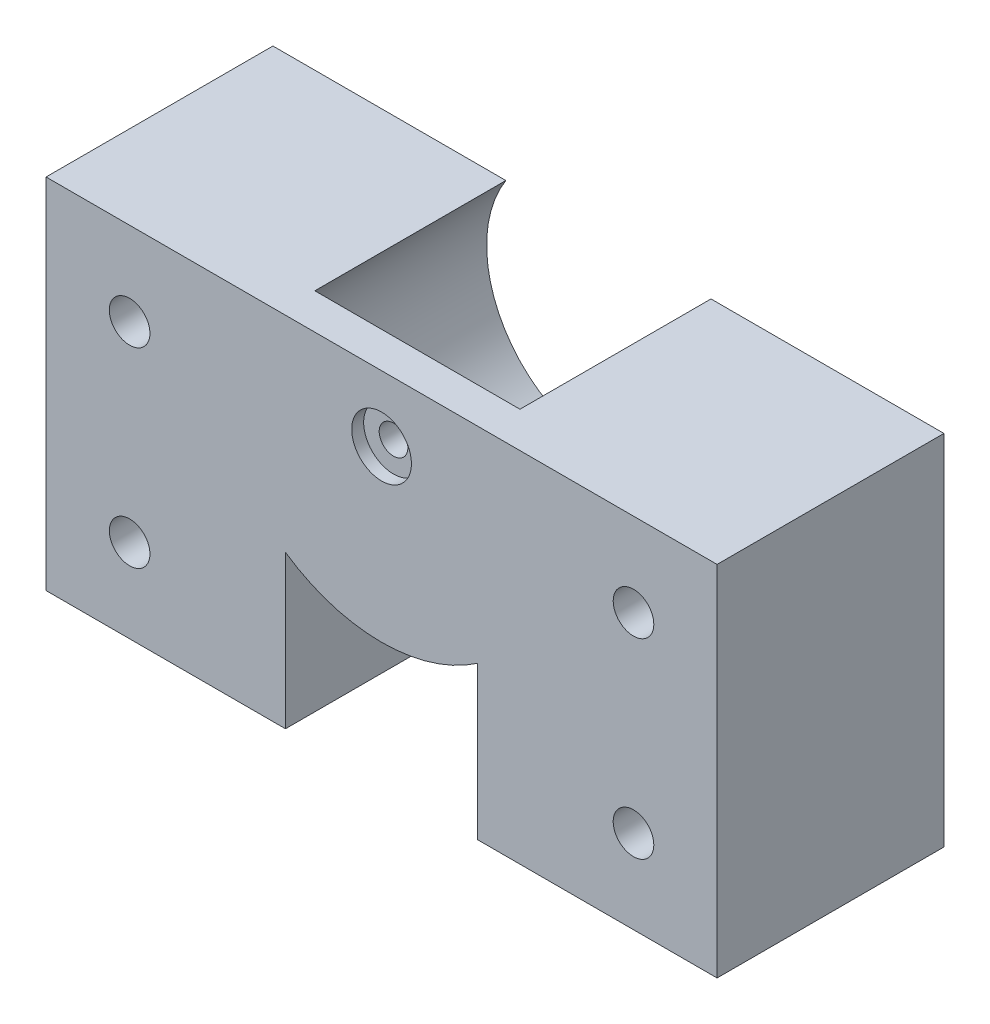
ISO-10303-21;
HEADER;
FILE_DESCRIPTION(('STEP AP214'),'2;1');
FILE_NAME('part.step','',(''),(''),'','','');
FILE_SCHEMA(('AUTOMOTIVE_DESIGN { 1 0 10303 214 1 1 1 1 }'));
ENDSEC;
DATA;
#1=APPLICATION_CONTEXT('core data for automotive mechanical design processes');
#2=APPLICATION_PROTOCOL_DEFINITION('international standard','automotive_design',2000,#1);
#3=PRODUCT_CONTEXT('',#1,'mechanical');
#4=PRODUCT('Part','Part','',(#3));
#5=PRODUCT_RELATED_PRODUCT_CATEGORY('part','',(#4));
#6=PRODUCT_DEFINITION_FORMATION('','',#4);
#7=PRODUCT_DEFINITION_CONTEXT('part definition',#1,'design');
#8=PRODUCT_DEFINITION('design','',#6,#7);
#9=PRODUCT_DEFINITION_SHAPE('','',#8);
#10=(LENGTH_UNIT() NAMED_UNIT(*) SI_UNIT(.MILLI.,.METRE.));
#11=(NAMED_UNIT(*) PLANE_ANGLE_UNIT() SI_UNIT($,.RADIAN.));
#12=(NAMED_UNIT(*) SI_UNIT($,.STERADIAN.) SOLID_ANGLE_UNIT());
#13=UNCERTAINTY_MEASURE_WITH_UNIT(LENGTH_MEASURE(1.E-05),#10,'distance_accuracy_value','');
#14=(GEOMETRIC_REPRESENTATION_CONTEXT(3) GLOBAL_UNCERTAINTY_ASSIGNED_CONTEXT((#13)) GLOBAL_UNIT_ASSIGNED_CONTEXT((#10,
#11,#12)) REPRESENTATION_CONTEXT('',''));
#15=CARTESIAN_POINT('',(0.,0.,0.));
#16=DIRECTION('',(0.,0.,1.));
#17=DIRECTION('',(1.,0.,0.));
#18=AXIS2_PLACEMENT_3D('',#15,#16,#17);
#19=CARTESIAN_POINT('',(28.1,-5.50000000000001,23.8083261120685));
#20=DIRECTION('',(0.,0.,-1.));
#21=DIRECTION('',(-1.,0.,0.));
#22=AXIS2_PLACEMENT_3D('',#19,#20,#21);
#23=CYLINDRICAL_SURFACE('',#22,1.2);
#24=CARTESIAN_POINT('',(28.1,-5.50000000000001,16.));
#25=DIRECTION('',(0.,0.,1.));
#26=DIRECTION('',(1.,0.,0.));
#27=AXIS2_PLACEMENT_3D('',#24,#25,#26);
#28=CIRCLE('',#27,1.2);
#29=CARTESIAN_POINT('',(29.3,-5.50000000000001,16.));
#30=VERTEX_POINT('',#29);
#31=EDGE_CURVE('E207',#30,#30,#28,.T.);
#32=ORIENTED_EDGE('',*,*,#31,.F.);
#33=EDGE_LOOP('',(#32));
#34=FACE_BOUND('',#33,.T.);
#35=CARTESIAN_POINT('',(28.1,-5.50000000000001,18.));
#36=DIRECTION('',(0.,0.,1.));
#37=DIRECTION('',(1.,0.,0.));
#38=AXIS2_PLACEMENT_3D('',#35,#36,#37);
#39=CIRCLE('',#38,1.2);
#40=CARTESIAN_POINT('',(29.3,-5.50000000000001,18.));
#41=VERTEX_POINT('',#40);
#42=EDGE_CURVE('E40',#41,#41,#39,.F.);
#43=ORIENTED_EDGE('',*,*,#42,.F.);
#44=EDGE_LOOP('',(#43));
#45=FACE_BOUND('',#44,.T.);
#46=ADVANCED_FACE('F36',(#34,#45),#23,.F.);
#47=CARTESIAN_POINT('',(-2.08166817117217E-13,-30.,16.));
#48=DIRECTION('',(0.,1.,0.));
#49=DIRECTION('',(-1.,0.,0.));
#50=AXIS2_PLACEMENT_3D('',#47,#48,#49);
#51=PLANE('',#50);
#52=DIRECTION('',(0.,0.,-1.));
#53=VECTOR('',#52,1.);
#54=CARTESIAN_POINT('',(36.15,-30.,19.001));
#55=LINE('',#54,#53);
#56=CARTESIAN_POINT('',(36.15,-30.,19.));
#57=VERTEX_POINT('',#56);
#58=CARTESIAN_POINT('',(36.15,-30.,0.));
#59=VERTEX_POINT('',#58);
#60=EDGE_CURVE('E123',#57,#59,#55,.T.);
#61=ORIENTED_EDGE('',*,*,#60,.T.);
#62=DIRECTION('',(1.,0.,0.));
#63=VECTOR('',#62,1.);
#64=CARTESIAN_POINT('',(-2.08166817117217E-13,-30.,0.));
#65=LINE('',#64,#63);
#66=CARTESIAN_POINT('',(56.2,-30.,0.));
#67=VERTEX_POINT('',#66);
#68=EDGE_CURVE('E163',#59,#67,#65,.T.);
#69=ORIENTED_EDGE('',*,*,#68,.T.);
#70=DIRECTION('',(0.,0.,-1.));
#71=VECTOR('',#70,1.);
#72=CARTESIAN_POINT('',(56.2,-30.,16.));
#73=LINE('',#72,#71);
#74=CARTESIAN_POINT('',(56.2,-29.9999999999996,19.));
#75=VERTEX_POINT('',#74);
#76=EDGE_CURVE('E172',#75,#67,#73,.T.);
#77=ORIENTED_EDGE('',*,*,#76,.F.);
#78=DIRECTION('',(1.,0.,0.));
#79=VECTOR('',#78,1.);
#80=CARTESIAN_POINT('',(-2.08166817117217E-13,-30.,19.));
#81=LINE('',#80,#79);
#82=EDGE_CURVE('E141',#57,#75,#81,.T.);
#83=ORIENTED_EDGE('',*,*,#82,.F.);
#84=EDGE_LOOP('',(#61,#69,#77,#83));
#85=FACE_BOUND('',#84,.T.);
#86=ADVANCED_FACE('F233',(#85),#51,.F.);
#87=DIRECTION('',(0.,0.,-1.));
#88=VECTOR('',#87,1.);
#89=CARTESIAN_POINT('',(20.05,-30.,19.001));
#90=LINE('',#89,#88);
#91=CARTESIAN_POINT('',(20.05,-29.9999999999999,19.));
#92=VERTEX_POINT('',#91);
#93=CARTESIAN_POINT('',(20.05,-30.,0.));
#94=VERTEX_POINT('',#93);
#95=EDGE_CURVE('E117',#92,#94,#90,.T.);
#96=ORIENTED_EDGE('',*,*,#95,.F.);
#97=CARTESIAN_POINT('',(-2.08166817117217E-13,-30.,19.));
#98=VERTEX_POINT('',#97);
#99=EDGE_CURVE('E130',#98,#92,#81,.T.);
#100=ORIENTED_EDGE('',*,*,#99,.F.);
#101=DIRECTION('',(0.,0.,-1.));
#102=VECTOR('',#101,1.);
#103=CARTESIAN_POINT('',(-2.08166817117217E-13,-30.,16.));
#104=LINE('',#103,#102);
#105=CARTESIAN_POINT('',(-2.08166817117217E-13,-30.,0.));
#106=VERTEX_POINT('',#105);
#107=EDGE_CURVE('E175',#98,#106,#104,.T.);
#108=ORIENTED_EDGE('',*,*,#107,.T.);
#109=EDGE_CURVE('E132',#106,#94,#65,.T.);
#110=ORIENTED_EDGE('',*,*,#109,.T.);
#111=EDGE_LOOP('',(#96,#100,#108,#110));
#112=FACE_BOUND('',#111,.T.);
#113=ADVANCED_FACE('F128',(#112),#51,.F.);
#114=CARTESIAN_POINT('',(28.1,-5.50000000000001,0.));
#115=DIRECTION('',(0.,0.,1.));
#116=DIRECTION('',(1.,0.,0.));
#117=AXIS2_PLACEMENT_3D('',#114,#115,#116);
#118=PLANE('',#117);
#119=CARTESIAN_POINT('',(49.1999999999998,-7.,0.));
#120=DIRECTION('',(0.,0.,-1.));
#121=DIRECTION('',(-1.,0.,0.));
#122=AXIS2_PLACEMENT_3D('',#119,#120,#121);
#123=CIRCLE('',#122,1.7);
#124=CARTESIAN_POINT('',(47.4999999999998,-7.,0.));
#125=VERTEX_POINT('',#124);
#126=EDGE_CURVE('E220',#125,#125,#123,.T.);
#127=ORIENTED_EDGE('',*,*,#126,.F.);
#128=EDGE_LOOP('',(#127));
#129=FACE_BOUND('',#128,.T.);
#130=CARTESIAN_POINT('',(49.1999999999998,-23.,0.));
#131=DIRECTION('',(0.,0.,-1.));
#132=DIRECTION('',(1.,0.,0.));
#133=AXIS2_PLACEMENT_3D('',#130,#131,#132);
#134=CIRCLE('',#133,1.69999999999999);
#135=CARTESIAN_POINT('',(50.8999999999998,-23.,0.));
#136=VERTEX_POINT('',#135);
#137=EDGE_CURVE('E199',#136,#136,#134,.T.);
#138=ORIENTED_EDGE('',*,*,#137,.F.);
#139=EDGE_LOOP('',(#138));
#140=FACE_BOUND('',#139,.T.);
#141=CARTESIAN_POINT('',(7.0000000000001,-23.0000000000001,0.));
#142=DIRECTION('',(0.,0.,-1.));
#143=DIRECTION('',(-1.,0.,0.));
#144=AXIS2_PLACEMENT_3D('',#141,#142,#143);
#145=CIRCLE('',#144,1.70000000000001);
#146=CARTESIAN_POINT('',(5.3000000000001,-23.0000000000001,0.));
#147=VERTEX_POINT('',#146);
#148=EDGE_CURVE('E208',#147,#147,#145,.T.);
#149=ORIENTED_EDGE('',*,*,#148,.F.);
#150=EDGE_LOOP('',(#149));
#151=FACE_BOUND('',#150,.T.);
#152=CARTESIAN_POINT('',(7.00000000000008,-6.99999999999992,0.));
#153=DIRECTION('',(0.,0.,-1.));
#154=DIRECTION('',(1.,0.,0.));
#155=AXIS2_PLACEMENT_3D('',#152,#153,#154);
#156=CIRCLE('',#155,1.7);
#157=CARTESIAN_POINT('',(8.70000000000008,-6.99999999999992,0.));
#158=VERTEX_POINT('',#157);
#159=EDGE_CURVE('E200',#158,#158,#156,.T.);
#160=ORIENTED_EDGE('',*,*,#159,.F.);
#161=EDGE_LOOP('',(#160));
#162=FACE_BOUND('',#161,.T.);
#163=DIRECTION('',(0.,1.,0.));
#164=VECTOR('',#163,1.);
#165=CARTESIAN_POINT('',(36.15,-30.,0.));
#166=LINE('',#165,#164);
#167=CARTESIAN_POINT('',(36.15,-17.1977561951,0.));
#168=VERTEX_POINT('',#167);
#169=EDGE_CURVE('E189',#59,#168,#166,.T.);
#170=ORIENTED_EDGE('',*,*,#169,.T.);
#171=CARTESIAN_POINT('',(28.1,-5.50000000000001,0.));
#172=DIRECTION('',(0.,0.,-1.));
#173=DIRECTION('',(1.,0.,0.));
#174=AXIS2_PLACEMENT_3D('',#171,#172,#173);
#175=CIRCLE('',#174,14.2);
#176=CARTESIAN_POINT('',(20.05,-17.1977561951,0.));
#177=VERTEX_POINT('',#176);
#178=EDGE_CURVE('E187',#168,#177,#175,.T.);
#179=ORIENTED_EDGE('',*,*,#178,.T.);
#180=DIRECTION('',(0.,-1.,0.));
#181=VECTOR('',#180,1.);
#182=CARTESIAN_POINT('',(20.05,-30.,0.));
#183=LINE('',#182,#181);
#184=EDGE_CURVE('E133',#177,#94,#183,.T.);
#185=ORIENTED_EDGE('',*,*,#184,.T.);
#186=ORIENTED_EDGE('',*,*,#109,.F.);
#187=DIRECTION('',(0.,-1.,0.));
#188=VECTOR('',#187,1.);
#189=CARTESIAN_POINT('',(0.,0.,0.));
#190=LINE('',#189,#188);
#191=CARTESIAN_POINT('',(0.,0.,0.));
#192=VERTEX_POINT('',#191);
#193=EDGE_CURVE('E161',#192,#106,#190,.T.);
#194=ORIENTED_EDGE('',*,*,#193,.F.);
#195=DIRECTION('',(-1.,0.,0.));
#196=VECTOR('',#195,1.);
#197=CARTESIAN_POINT('',(19.5098894069982,0.,0.));
#198=LINE('',#197,#196);
#199=CARTESIAN_POINT('',(19.5098894069982,0.,0.));
#200=VERTEX_POINT('',#199);
#201=EDGE_CURVE('E159',#200,#192,#198,.T.);
#202=ORIENTED_EDGE('',*,*,#201,.F.);
#203=CARTESIAN_POINT('',(28.1,-5.50000000000001,0.));
#204=DIRECTION('',(0.,0.,-1.));
#205=DIRECTION('',(1.,0.,0.));
#206=AXIS2_PLACEMENT_3D('',#203,#204,#205);
#207=CIRCLE('',#206,10.2);
#208=CARTESIAN_POINT('',(36.6901105930017,0.,0.));
#209=VERTEX_POINT('',#208);
#210=EDGE_CURVE('E60',#209,#200,#207,.T.);
#211=ORIENTED_EDGE('',*,*,#210,.F.);
#212=DIRECTION('',(-1.,0.,0.));
#213=VECTOR('',#212,1.);
#214=CARTESIAN_POINT('',(35.8259303646874,0.,0.));
#215=LINE('',#214,#213);
#216=CARTESIAN_POINT('',(56.1999999999998,0.,0.));
#217=VERTEX_POINT('',#216);
#218=EDGE_CURVE('E157',#217,#209,#215,.T.);
#219=ORIENTED_EDGE('',*,*,#218,.F.);
#220=DIRECTION('',(0.,1.,0.));
#221=VECTOR('',#220,1.);
#222=CARTESIAN_POINT('',(56.1999999999998,0.,0.));
#223=LINE('',#222,#221);
#224=EDGE_CURVE('E165',#67,#217,#223,.T.);
#225=ORIENTED_EDGE('',*,*,#224,.F.);
#226=ORIENTED_EDGE('',*,*,#68,.F.);
#227=EDGE_LOOP('',(#170,#179,#185,#186,#194,#202,#211,#219,#225,#226));
#228=FACE_BOUND('',#227,.T.);
#229=ADVANCED_FACE('F184',(#129,#140,#151,#162,#228),#118,.F.);
#230=CARTESIAN_POINT('',(0.,0.,19.));
#231=DIRECTION('',(0.,0.,1.));
#232=DIRECTION('',(1.,0.,0.));
#233=AXIS2_PLACEMENT_3D('',#230,#231,#232);
#234=PLANE('',#233);
#235=CARTESIAN_POINT('',(28.1,-5.50000000000001,19.));
#236=DIRECTION('',(0.,0.,1.));
#237=DIRECTION('',(1.,0.,0.));
#238=AXIS2_PLACEMENT_3D('',#235,#236,#237);
#239=CIRCLE('',#238,2.5);
#240=CARTESIAN_POINT('',(30.6,-5.50000000000001,19.));
#241=VERTEX_POINT('',#240);
#242=EDGE_CURVE('E243',#241,#241,#239,.T.);
#243=ORIENTED_EDGE('',*,*,#242,.F.);
#244=EDGE_LOOP('',(#243));
#245=FACE_BOUND('',#244,.T.);
#246=CARTESIAN_POINT('',(7.00000000000008,-6.99999999999992,19.));
#247=DIRECTION('',(0.,0.,1.));
#248=DIRECTION('',(1.,0.,0.));
#249=AXIS2_PLACEMENT_3D('',#246,#247,#248);
#250=CIRCLE('',#249,1.7);
#251=CARTESIAN_POINT('',(8.70000000000008,-6.99999999999992,19.));
#252=VERTEX_POINT('',#251);
#253=EDGE_CURVE('E203',#252,#252,#250,.F.);
#254=ORIENTED_EDGE('',*,*,#253,.T.);
#255=EDGE_LOOP('',(#254));
#256=FACE_BOUND('',#255,.T.);
#257=CARTESIAN_POINT('',(7.0000000000001,-23.0000000000001,19.));
#258=DIRECTION('',(0.,0.,1.));
#259=DIRECTION('',(1.,0.,0.));
#260=AXIS2_PLACEMENT_3D('',#257,#258,#259);
#261=CIRCLE('',#260,1.70000000000001);
#262=CARTESIAN_POINT('',(8.70000000000011,-23.0000000000001,19.));
#263=VERTEX_POINT('',#262);
#264=EDGE_CURVE('E204',#263,#263,#261,.F.);
#265=ORIENTED_EDGE('',*,*,#264,.T.);
#266=EDGE_LOOP('',(#265));
#267=FACE_BOUND('',#266,.T.);
#268=CARTESIAN_POINT('',(49.1999999999998,-23.,19.));
#269=DIRECTION('',(0.,0.,1.));
#270=DIRECTION('',(1.,0.,0.));
#271=AXIS2_PLACEMENT_3D('',#268,#269,#270);
#272=CIRCLE('',#271,1.69999999999999);
#273=CARTESIAN_POINT('',(50.8999999999998,-23.,19.));
#274=VERTEX_POINT('',#273);
#275=EDGE_CURVE('E211',#274,#274,#272,.F.);
#276=ORIENTED_EDGE('',*,*,#275,.T.);
#277=EDGE_LOOP('',(#276));
#278=FACE_BOUND('',#277,.T.);
#279=CARTESIAN_POINT('',(49.1999999999998,-7.,19.));
#280=DIRECTION('',(0.,0.,1.));
#281=DIRECTION('',(1.,0.,0.));
#282=AXIS2_PLACEMENT_3D('',#279,#280,#281);
#283=CIRCLE('',#282,1.7);
#284=CARTESIAN_POINT('',(50.8999999999998,-7.,19.));
#285=VERTEX_POINT('',#284);
#286=EDGE_CURVE('E152',#285,#285,#283,.F.);
#287=ORIENTED_EDGE('',*,*,#286,.T.);
#288=EDGE_LOOP('',(#287));
#289=FACE_BOUND('',#288,.T.);
#290=CARTESIAN_POINT('',(28.1,-5.50000000000001,19.));
#291=DIRECTION('',(0.,0.,1.));
#292=DIRECTION('',(1.,0.,0.));
#293=AXIS2_PLACEMENT_3D('',#290,#291,#292);
#294=CIRCLE('',#293,14.2);
#295=CARTESIAN_POINT('',(36.15,-17.1977561951,19.));
#296=VERTEX_POINT('',#295);
#297=CARTESIAN_POINT('',(20.05,-17.1977561951,19.));
#298=VERTEX_POINT('',#297);
#299=EDGE_CURVE('E52',#296,#298,#294,.F.);
#300=ORIENTED_EDGE('',*,*,#299,.F.);
#301=DIRECTION('',(0.,1.,0.));
#302=VECTOR('',#301,1.);
#303=CARTESIAN_POINT('',(36.15,-30.,19.));
#304=LINE('',#303,#302);
#305=EDGE_CURVE('E239',#57,#296,#304,.T.);
#306=ORIENTED_EDGE('',*,*,#305,.F.);
#307=ORIENTED_EDGE('',*,*,#82,.T.);
#308=DIRECTION('',(0.,1.,0.));
#309=VECTOR('',#308,1.);
#310=CARTESIAN_POINT('',(56.2,-29.9999999999996,19.));
#311=LINE('',#310,#309);
#312=CARTESIAN_POINT('',(56.1999999999998,0.,19.));
#313=VERTEX_POINT('',#312);
#314=EDGE_CURVE('E140',#75,#313,#311,.T.);
#315=ORIENTED_EDGE('',*,*,#314,.T.);
#316=DIRECTION('',(-1.,0.,0.));
#317=VECTOR('',#316,1.);
#318=CARTESIAN_POINT('',(0.,0.,19.));
#319=LINE('',#318,#317);
#320=CARTESIAN_POINT('',(0.,0.,19.));
#321=VERTEX_POINT('',#320);
#322=EDGE_CURVE('E151',#313,#321,#319,.T.);
#323=ORIENTED_EDGE('',*,*,#322,.T.);
#324=DIRECTION('',(0.,-1.,0.));
#325=VECTOR('',#324,1.);
#326=CARTESIAN_POINT('',(0.,0.,19.));
#327=LINE('',#326,#325);
#328=EDGE_CURVE('E139',#321,#98,#327,.T.);
#329=ORIENTED_EDGE('',*,*,#328,.T.);
#330=ORIENTED_EDGE('',*,*,#99,.T.);
#331=DIRECTION('',(0.,-1.,0.));
#332=VECTOR('',#331,1.);
#333=CARTESIAN_POINT('',(20.05,-30.,19.));
#334=LINE('',#333,#332);
#335=EDGE_CURVE('E113',#298,#92,#334,.T.);
#336=ORIENTED_EDGE('',*,*,#335,.F.);
#337=EDGE_LOOP('',(#300,#306,#307,#315,#323,#329,#330,#336));
#338=FACE_BOUND('',#337,.T.);
#339=ADVANCED_FACE('F136',(#245,#256,#267,#278,#289,#338),#234,.T.);
#340=CARTESIAN_POINT('',(28.1,-5.50000000000001,16.));
#341=DIRECTION('',(0.,0.,-1.));
#342=DIRECTION('',(-1.,0.,0.));
#343=AXIS2_PLACEMENT_3D('',#340,#341,#342);
#344=CYLINDRICAL_SURFACE('',#343,10.2);
#345=ORIENTED_EDGE('',*,*,#210,.T.);
#346=DIRECTION('',(0.,0.,-1.));
#347=VECTOR('',#346,1.);
#348=CARTESIAN_POINT('',(19.5098894069982,0.,16.));
#349=LINE('',#348,#347);
#350=CARTESIAN_POINT('',(19.5098894069982,0.,16.));
#351=VERTEX_POINT('',#350);
#352=EDGE_CURVE('E11',#351,#200,#349,.T.);
#353=ORIENTED_EDGE('',*,*,#352,.F.);
#354=CARTESIAN_POINT('',(28.1,-5.50000000000001,16.));
#355=DIRECTION('',(0.,0.,-1.));
#356=DIRECTION('',(1.,0.,0.));
#357=AXIS2_PLACEMENT_3D('',#354,#355,#356);
#358=CIRCLE('',#357,10.2);
#359=CARTESIAN_POINT('',(36.6901105930017,0.,16.));
#360=VERTEX_POINT('',#359);
#361=EDGE_CURVE('E153',#360,#351,#358,.T.);
#362=ORIENTED_EDGE('',*,*,#361,.F.);
#363=DIRECTION('',(0.,0.,-1.));
#364=VECTOR('',#363,1.);
#365=CARTESIAN_POINT('',(36.6901105930017,0.,41.741989045138));
#366=LINE('',#365,#364);
#367=EDGE_CURVE('E122',#360,#209,#366,.T.);
#368=ORIENTED_EDGE('',*,*,#367,.T.);
#369=EDGE_LOOP('',(#345,#353,#362,#368));
#370=FACE_BOUND('',#369,.T.);
#371=ADVANCED_FACE('F38',(#370),#344,.F.);
#372=CARTESIAN_POINT('',(0.,0.,16.));
#373=DIRECTION('',(1.,0.,0.));
#374=DIRECTION('',(0.,1.,0.));
#375=AXIS2_PLACEMENT_3D('',#372,#373,#374);
#376=PLANE('',#375);
#377=ORIENTED_EDGE('',*,*,#193,.T.);
#378=ORIENTED_EDGE('',*,*,#107,.F.);
#379=ORIENTED_EDGE('',*,*,#328,.F.);
#380=DIRECTION('',(0.,0.,-1.));
#381=VECTOR('',#380,1.);
#382=CARTESIAN_POINT('',(0.,0.,16.));
#383=LINE('',#382,#381);
#384=EDGE_CURVE('E45',#321,#192,#383,.T.);
#385=ORIENTED_EDGE('',*,*,#384,.T.);
#386=EDGE_LOOP('',(#377,#378,#379,#385));
#387=FACE_BOUND('',#386,.T.);
#388=ADVANCED_FACE('F180',(#387),#376,.F.);
#389=CARTESIAN_POINT('',(56.1999999999998,0.,16.));
#390=DIRECTION('',(-1.,0.,0.));
#391=DIRECTION('',(0.,-1.,0.));
#392=AXIS2_PLACEMENT_3D('',#389,#390,#391);
#393=PLANE('',#392);
#394=ORIENTED_EDGE('',*,*,#224,.T.);
#395=DIRECTION('',(0.,0.,-1.));
#396=VECTOR('',#395,1.);
#397=CARTESIAN_POINT('',(56.1999999999998,0.,16.));
#398=LINE('',#397,#396);
#399=EDGE_CURVE('E156',#313,#217,#398,.T.);
#400=ORIENTED_EDGE('',*,*,#399,.F.);
#401=ORIENTED_EDGE('',*,*,#314,.F.);
#402=ORIENTED_EDGE('',*,*,#76,.T.);
#403=EDGE_LOOP('',(#394,#400,#401,#402));
#404=FACE_BOUND('',#403,.T.);
#405=ADVANCED_FACE('F228',(#404),#393,.F.);
#406=CARTESIAN_POINT('',(35.8259303646874,0.,16.));
#407=DIRECTION('',(0.,-1.,0.));
#408=DIRECTION('',(0.,0.,-1.));
#409=AXIS2_PLACEMENT_3D('',#406,#407,#408);
#410=PLANE('',#409);
#411=ORIENTED_EDGE('',*,*,#367,.F.);
#412=DIRECTION('',(-1.,0.,0.));
#413=VECTOR('',#412,1.);
#414=CARTESIAN_POINT('',(0.,0.,16.));
#415=LINE('',#414,#413);
#416=EDGE_CURVE('E148',#360,#351,#415,.T.);
#417=ORIENTED_EDGE('',*,*,#416,.T.);
#418=ORIENTED_EDGE('',*,*,#352,.T.);
#419=ORIENTED_EDGE('',*,*,#201,.T.);
#420=ORIENTED_EDGE('',*,*,#384,.F.);
#421=ORIENTED_EDGE('',*,*,#322,.F.);
#422=ORIENTED_EDGE('',*,*,#399,.T.);
#423=ORIENTED_EDGE('',*,*,#218,.T.);
#424=EDGE_LOOP('',(#411,#417,#418,#419,#420,#421,#422,#423));
#425=FACE_BOUND('',#424,.T.);
#426=ADVANCED_FACE('F226',(#425),#410,.F.);
#427=CARTESIAN_POINT('',(0.,0.,16.));
#428=DIRECTION('',(0.,0.,1.));
#429=DIRECTION('',(1.,0.,0.));
#430=AXIS2_PLACEMENT_3D('',#427,#428,#429);
#431=PLANE('',#430);
#432=ORIENTED_EDGE('',*,*,#31,.T.);
#433=EDGE_LOOP('',(#432));
#434=FACE_BOUND('',#433,.T.);
#435=ORIENTED_EDGE('',*,*,#416,.F.);
#436=ORIENTED_EDGE('',*,*,#361,.T.);
#437=EDGE_LOOP('',(#435,#436));
#438=FACE_BOUND('',#437,.T.);
#439=ADVANCED_FACE('F270',(#434,#438),#431,.F.);
#440=CARTESIAN_POINT('',(49.1999999999998,-7.,23.8083261120685));
#441=DIRECTION('',(0.,0.,-1.));
#442=DIRECTION('',(-1.,0.,0.));
#443=AXIS2_PLACEMENT_3D('',#440,#441,#442);
#444=CYLINDRICAL_SURFACE('',#443,1.7);
#445=ORIENTED_EDGE('',*,*,#126,.T.);
#446=EDGE_LOOP('',(#445));
#447=FACE_BOUND('',#446,.T.);
#448=ORIENTED_EDGE('',*,*,#286,.F.);
#449=EDGE_LOOP('',(#448));
#450=FACE_BOUND('',#449,.T.);
#451=ADVANCED_FACE('F267',(#447,#450),#444,.F.);
#452=CARTESIAN_POINT('',(49.1999999999998,-23.,23.8083261120685));
#453=DIRECTION('',(0.,0.,-1.));
#454=DIRECTION('',(-1.,0.,0.));
#455=AXIS2_PLACEMENT_3D('',#452,#453,#454);
#456=CYLINDRICAL_SURFACE('',#455,1.69999999999999);
#457=ORIENTED_EDGE('',*,*,#137,.T.);
#458=EDGE_LOOP('',(#457));
#459=FACE_BOUND('',#458,.T.);
#460=ORIENTED_EDGE('',*,*,#275,.F.);
#461=EDGE_LOOP('',(#460));
#462=FACE_BOUND('',#461,.T.);
#463=ADVANCED_FACE('F265',(#459,#462),#456,.F.);
#464=CARTESIAN_POINT('',(7.0000000000001,-23.0000000000001,23.8083261120685));
#465=DIRECTION('',(0.,0.,-1.));
#466=DIRECTION('',(-1.,0.,0.));
#467=AXIS2_PLACEMENT_3D('',#464,#465,#466);
#468=CYLINDRICAL_SURFACE('',#467,1.70000000000001);
#469=ORIENTED_EDGE('',*,*,#148,.T.);
#470=EDGE_LOOP('',(#469));
#471=FACE_BOUND('',#470,.T.);
#472=ORIENTED_EDGE('',*,*,#264,.F.);
#473=EDGE_LOOP('',(#472));
#474=FACE_BOUND('',#473,.T.);
#475=ADVANCED_FACE('F353',(#471,#474),#468,.F.);
#476=CARTESIAN_POINT('',(7.00000000000008,-6.99999999999992,23.8083261120685));
#477=DIRECTION('',(0.,0.,-1.));
#478=DIRECTION('',(-1.,0.,0.));
#479=AXIS2_PLACEMENT_3D('',#476,#477,#478);
#480=CYLINDRICAL_SURFACE('',#479,1.7);
#481=ORIENTED_EDGE('',*,*,#159,.T.);
#482=EDGE_LOOP('',(#481));
#483=FACE_BOUND('',#482,.T.);
#484=ORIENTED_EDGE('',*,*,#253,.F.);
#485=EDGE_LOOP('',(#484));
#486=FACE_BOUND('',#485,.T.);
#487=ADVANCED_FACE('F361',(#483,#486),#480,.F.);
#488=CARTESIAN_POINT('',(36.15,-30.,19.001));
#489=DIRECTION('',(-1.,0.,0.));
#490=DIRECTION('',(0.,0.,1.));
#491=AXIS2_PLACEMENT_3D('',#488,#489,#490);
#492=PLANE('',#491);
#493=ORIENTED_EDGE('',*,*,#305,.T.);
#494=DIRECTION('',(0.,0.,-1.));
#495=VECTOR('',#494,1.);
#496=CARTESIAN_POINT('',(36.15,-17.1977561951,19.001));
#497=LINE('',#496,#495);
#498=EDGE_CURVE('E194',#296,#168,#497,.T.);
#499=ORIENTED_EDGE('',*,*,#498,.T.);
#500=ORIENTED_EDGE('',*,*,#169,.F.);
#501=ORIENTED_EDGE('',*,*,#60,.F.);
#502=EDGE_LOOP('',(#493,#499,#500,#501));
#503=FACE_BOUND('',#502,.T.);
#504=ADVANCED_FACE('F238',(#503),#492,.T.);
#505=CARTESIAN_POINT('',(28.1,-5.50000000000001,19.001));
#506=DIRECTION('',(0.,0.,-1.));
#507=DIRECTION('',(-1.,0.,0.));
#508=AXIS2_PLACEMENT_3D('',#505,#506,#507);
#509=CYLINDRICAL_SURFACE('',#508,14.2);
#510=ORIENTED_EDGE('',*,*,#299,.T.);
#511=DIRECTION('',(0.,0.,-1.));
#512=VECTOR('',#511,1.);
#513=CARTESIAN_POINT('',(20.05,-17.1977561951,19.001));
#514=LINE('',#513,#512);
#515=EDGE_CURVE('E119',#298,#177,#514,.T.);
#516=ORIENTED_EDGE('',*,*,#515,.T.);
#517=ORIENTED_EDGE('',*,*,#178,.F.);
#518=ORIENTED_EDGE('',*,*,#498,.F.);
#519=EDGE_LOOP('',(#510,#516,#517,#518));
#520=FACE_BOUND('',#519,.T.);
#521=ADVANCED_FACE('F377',(#520),#509,.T.);
#522=CARTESIAN_POINT('',(20.05,-30.,19.001));
#523=DIRECTION('',(1.,0.,0.));
#524=DIRECTION('',(0.,1.,0.));
#525=AXIS2_PLACEMENT_3D('',#522,#523,#524);
#526=PLANE('',#525);
#527=ORIENTED_EDGE('',*,*,#335,.T.);
#528=ORIENTED_EDGE('',*,*,#95,.T.);
#529=ORIENTED_EDGE('',*,*,#184,.F.);
#530=ORIENTED_EDGE('',*,*,#515,.F.);
#531=EDGE_LOOP('',(#527,#528,#529,#530));
#532=FACE_BOUND('',#531,.T.);
#533=ADVANCED_FACE('F115',(#532),#526,.T.);
#534=CARTESIAN_POINT('',(28.1,-5.50000000000001,18.));
#535=DIRECTION('',(0.,0.,1.));
#536=DIRECTION('',(1.,0.,0.));
#537=AXIS2_PLACEMENT_3D('',#534,#535,#536);
#538=PLANE('',#537);
#539=CARTESIAN_POINT('',(28.1,-5.50000000000001,18.));
#540=DIRECTION('',(0.,0.,1.));
#541=DIRECTION('',(1.,0.,0.));
#542=AXIS2_PLACEMENT_3D('',#539,#540,#541);
#543=CIRCLE('',#542,2.5);
#544=CARTESIAN_POINT('',(30.6,-5.50000000000001,18.));
#545=VERTEX_POINT('',#544);
#546=EDGE_CURVE('E246',#545,#545,#543,.T.);
#547=ORIENTED_EDGE('',*,*,#546,.T.);
#548=EDGE_LOOP('',(#547));
#549=FACE_BOUND('',#548,.T.);
#550=ORIENTED_EDGE('',*,*,#42,.T.);
#551=EDGE_LOOP('',(#550));
#552=FACE_BOUND('',#551,.T.);
#553=ADVANCED_FACE('F253',(#549,#552),#538,.T.);
#554=CARTESIAN_POINT('',(28.1,-5.50000000000001,18.));
#555=DIRECTION('',(0.,0.,1.));
#556=DIRECTION('',(1.,0.,0.));
#557=AXIS2_PLACEMENT_3D('',#554,#555,#556);
#558=CYLINDRICAL_SURFACE('',#557,2.5);
#559=ORIENTED_EDGE('',*,*,#546,.F.);
#560=EDGE_LOOP('',(#559));
#561=FACE_BOUND('',#560,.T.);
#562=ORIENTED_EDGE('',*,*,#242,.T.);
#563=EDGE_LOOP('',(#562));
#564=FACE_BOUND('',#563,.T.);
#565=ADVANCED_FACE('F394',(#561,#564),#558,.F.);
#566=CLOSED_SHELL('',(#46,#86,#113,#229,#339,#371,#388,#405,#426,#439,#451,#463,#475,#487,#504,
#521,#533,#553,#565));
#567=MANIFOLD_SOLID_BREP('B2',#566);
#568=ADVANCED_BREP_SHAPE_REPRESENTATION('',(#18,#567),#14);
#569=SHAPE_DEFINITION_REPRESENTATION(#9,#568);
ENDSEC;
END-ISO-10303-21;
